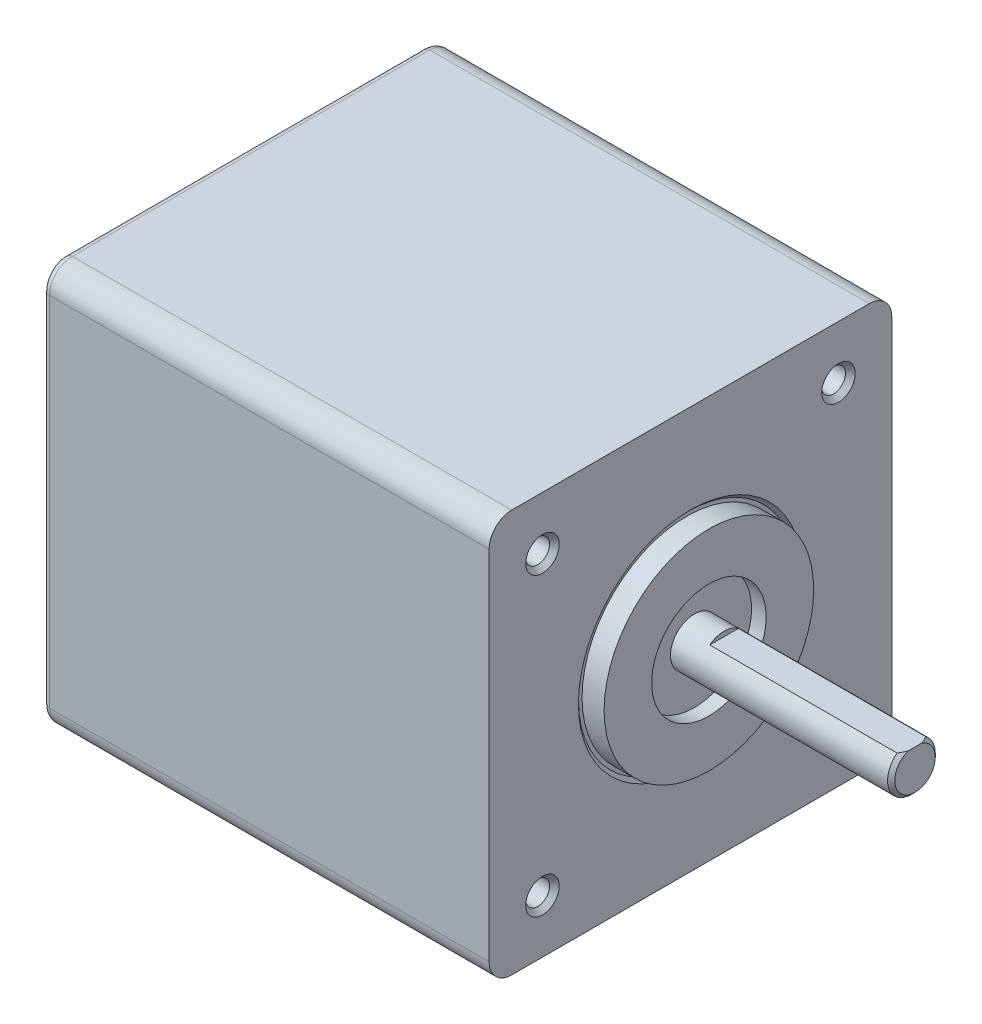
ISO-10303-21;
HEADER;
FILE_DESCRIPTION(('STEP AP214'),'2;1');
FILE_NAME('part.step','',(''),(''),'','','');
FILE_SCHEMA(('AUTOMOTIVE_DESIGN { 1 0 10303 214 1 1 1 1 }'));
ENDSEC;
DATA;
#1=APPLICATION_CONTEXT('core data for automotive mechanical design processes');
#2=APPLICATION_PROTOCOL_DEFINITION('international standard','automotive_design',2000,#1);
#3=PRODUCT_CONTEXT('',#1,'mechanical');
#4=PRODUCT('Part','Part','',(#3));
#5=PRODUCT_RELATED_PRODUCT_CATEGORY('part','',(#4));
#6=PRODUCT_DEFINITION_FORMATION('','',#4);
#7=PRODUCT_DEFINITION_CONTEXT('part definition',#1,'design');
#8=PRODUCT_DEFINITION('design','',#6,#7);
#9=PRODUCT_DEFINITION_SHAPE('','',#8);
#10=(LENGTH_UNIT() NAMED_UNIT(*) SI_UNIT(.MILLI.,.METRE.));
#11=(NAMED_UNIT(*) PLANE_ANGLE_UNIT() SI_UNIT($,.RADIAN.));
#12=(NAMED_UNIT(*) SI_UNIT($,.STERADIAN.) SOLID_ANGLE_UNIT());
#13=UNCERTAINTY_MEASURE_WITH_UNIT(LENGTH_MEASURE(1.E-05),#10,'distance_accuracy_value','');
#14=(GEOMETRIC_REPRESENTATION_CONTEXT(3) GLOBAL_UNCERTAINTY_ASSIGNED_CONTEXT((#13)) GLOBAL_UNIT_ASSIGNED_CONTEXT((#10,
#11,#12)) REPRESENTATION_CONTEXT('',''));
#15=CARTESIAN_POINT('',(0.,0.,0.));
#16=DIRECTION('',(0.,0.,1.));
#17=DIRECTION('',(1.,0.,0.));
#18=AXIS2_PLACEMENT_3D('',#15,#16,#17);
#19=CARTESIAN_POINT('',(23.5204,0.,0.));
#20=DIRECTION('',(1.,0.,0.));
#21=DIRECTION('',(0.,0.,-1.));
#22=AXIS2_PLACEMENT_3D('',#19,#20,#21);
#23=PLANE('',#22);
#24=CARTESIAN_POINT('',(23.5204,0.,0.));
#25=DIRECTION('',(1.,0.,0.));
#26=DIRECTION('',(0.,0.,-1.));
#27=AXIS2_PLACEMENT_3D('',#24,#25,#26);
#28=CIRCLE('',#27,2.11900000000001);
#29=CARTESIAN_POINT('',(23.5204,2.,0.700114990555153));
#30=VERTEX_POINT('',#29);
#31=CARTESIAN_POINT('',(23.5204,2.,-0.700114990555153));
#32=VERTEX_POINT('',#31);
#33=EDGE_CURVE('E264',#30,#32,#28,.T.);
#34=ORIENTED_EDGE('',*,*,#33,.T.);
#35=DIRECTION('',(0.,0.,1.));
#36=VECTOR('',#35,1.);
#37=CARTESIAN_POINT('',(23.5204,2.,0.));
#38=LINE('',#37,#36);
#39=EDGE_CURVE('E326',#32,#30,#38,.T.);
#40=ORIENTED_EDGE('',*,*,#39,.T.);
#41=EDGE_LOOP('',(#34,#40));
#42=FACE_BOUND('',#41,.T.);
#43=ADVANCED_FACE('F37',(#42),#23,.T.);
#44=CARTESIAN_POINT('',(23.5204,0.,0.));
#45=DIRECTION('',(-1.,0.,0.));
#46=DIRECTION('',(0.,0.,1.));
#47=AXIS2_PLACEMENT_3D('',#44,#45,#46);
#48=CONICAL_SURFACE('',#47,2.11900000000001,0.785398163397436);
#49=CARTESIAN_POINT('',(23.1394,0.,0.));
#50=DIRECTION('',(1.,0.,0.));
#51=DIRECTION('',(0.,0.,-1.));
#52=AXIS2_PLACEMENT_3D('',#49,#50,#51);
#53=CIRCLE('',#52,2.5);
#54=CARTESIAN_POINT('',(23.1394,2.,-1.5));
#55=VERTEX_POINT('',#54);
#56=CARTESIAN_POINT('',(23.1394,2.,1.5));
#57=VERTEX_POINT('',#56);
#58=EDGE_CURVE('E262',#55,#57,#53,.F.);
#59=ORIENTED_EDGE('',*,*,#58,.F.);
#60=CARTESIAN_POINT('',(20.1305029464567,2.,-5.13302510675109));
#61=CARTESIAN_POINT('',(20.2766432152961,2.,-4.97613758066621));
#62=CARTESIAN_POINT('',(20.4223570329769,2.,-4.81884691498693));
#63=CARTESIAN_POINT('',(20.7125635794047,2.,-4.50307826927214));
#64=CARTESIAN_POINT('',(20.8570560238053,2.,-4.34460002812423));
#65=CARTESIAN_POINT('',(21.1453468548776,2.,-4.02507998203707));
#66=CARTESIAN_POINT('',(21.2891341179465,2.,-3.8640281174624));
#67=CARTESIAN_POINT('',(21.5743404090381,2.,-3.53986969558392));
#68=CARTESIAN_POINT('',(21.7157597393123,2.,-3.37676340524412));
#69=CARTESIAN_POINT('',(21.9672522314341,2.,-3.08050401123835));
#70=CARTESIAN_POINT('',(22.0779430895347,2.,-2.94787719458969));
#71=CARTESIAN_POINT('',(22.296253159248,2.,-2.68004897490099));
#72=CARTESIAN_POINT('',(22.403871504256,2.,-2.54484686307786));
#73=CARTESIAN_POINT('',(22.6144375947664,2.,-2.27114173408944));
#74=CARTESIAN_POINT('',(22.7173923563596,2.,-2.13264418837074));
#75=CARTESIAN_POINT('',(22.8665613386814,2.,-1.92122241464145));
#76=CARTESIAN_POINT('',(22.9153974728354,2.,-1.85015116668835));
#77=CARTESIAN_POINT('',(23.0108356281588,2.,-1.7065288029276));
#78=CARTESIAN_POINT('',(23.0574379406813,2.,-1.63397788188007));
#79=CARTESIAN_POINT('',(23.1435132711357,2.,-1.49405328577463));
#80=CARTESIAN_POINT('',(23.1832437314983,2.,-1.42683879516308));
#81=CARTESIAN_POINT('',(23.2597251307717,2.,-1.29074520388191));
#82=CARTESIAN_POINT('',(23.2964767330448,2.,-1.22186647828056));
#83=CARTESIAN_POINT('',(23.3661825566363,2.,-1.08220710139237));
#84=CARTESIAN_POINT('',(23.3991376975225,2.,-1.01142691581554));
#85=CARTESIAN_POINT('',(23.4602026851904,2.,-0.867834455711161));
#86=CARTESIAN_POINT('',(23.4883137645082,2.,-0.795022703595676));
#87=CARTESIAN_POINT('',(23.5530039317306,2.,-0.60420200415091));
#88=CARTESIAN_POINT('',(23.5850087876338,2.,-0.484519942763115));
#89=CARTESIAN_POINT('',(23.6175396186327,2.,-0.302480656630293));
#90=CARTESIAN_POINT('',(23.6258030330222,2.,-0.241467844347049));
#91=CARTESIAN_POINT('',(23.6367938274565,2.,-0.118931461021051));
#92=CARTESIAN_POINT('',(23.6395215657536,2.,-0.0574079232896734));
#93=CARTESIAN_POINT('',(23.6392695765936,2.,0.0658292385110691));
#94=CARTESIAN_POINT('',(23.6362708835473,2.,0.127542816035695));
#95=CARTESIAN_POINT('',(23.6247096799287,2.,0.250442666239599));
#96=CARTESIAN_POINT('',(23.6161467429709,2.,0.311628898144493));
#97=CARTESIAN_POINT('',(23.5938892862127,2.,0.433247138403839));
#98=CARTESIAN_POINT('',(23.5801786472414,2.,0.49367615493009));
#99=CARTESIAN_POINT('',(23.5482669478063,2.,0.613320542096463));
#100=CARTESIAN_POINT('',(23.530065625888,2.,0.672535841854645));
#101=CARTESIAN_POINT('',(23.466054269673,2.,0.859006024992759));
#102=CARTESIAN_POINT('',(23.4130731188719,2.,0.983799289462164));
#103=CARTESIAN_POINT('',(23.2951299884697,2.,1.22761567085784));
#104=CARTESIAN_POINT('',(23.2301442899397,2.,1.34662676472427));
#105=CARTESIAN_POINT('',(23.0914542881311,2.,1.58148641293894));
#106=CARTESIAN_POINT('',(23.0176475477158,2.,1.69727367207162));
#107=CARTESIAN_POINT('',(22.8647219139337,2.,1.92508227457241));
#108=CARTESIAN_POINT('',(22.7856078577529,2.,2.03710691116717));
#109=CARTESIAN_POINT('',(22.6044234015249,2.,2.2846894222414));
#110=CARTESIAN_POINT('',(22.5013629666408,2.,2.41951842464185));
#111=CARTESIAN_POINT('',(22.2914325532921,2.,2.68618956943834));
#112=CARTESIAN_POINT('',(22.1845618876755,2.,2.81803116599015));
#113=CARTESIAN_POINT('',(21.9680490707759,2.,3.07964382038147));
#114=CARTESIAN_POINT('',(21.8584041302411,2.,3.20941256154911));
#115=CARTESIAN_POINT('',(21.637182470088,2.,3.46729402373802));
#116=CARTESIAN_POINT('',(21.5256056947972,2.,3.59540669684749));
#117=CARTESIAN_POINT('',(21.3081752038851,2.,3.84222486610579));
#118=CARTESIAN_POINT('',(21.2024105879427,2.,3.9610090127681));
#119=CARTESIAN_POINT('',(20.9898923952322,2.,4.19769358244472));
#120=CARTESIAN_POINT('',(20.8831387940655,2.,4.31559398352618));
#121=CARTESIAN_POINT('',(20.6690928849223,2.,4.55041590189734));
#122=CARTESIAN_POINT('',(20.5618023425473,2.,4.66733903052806));
#123=CARTESIAN_POINT('',(20.3465910389449,2.,4.9005935276883));
#124=CARTESIAN_POINT('',(20.2386703086898,2.,5.01692492478288));
#125=CARTESIAN_POINT('',(20.1305029464567,2.,5.13302510675109));
#126=B_SPLINE_CURVE_WITH_KNOTS('',3,(#60,#61,#62,#63,#64,#65,#66,#67,#68,#69,#70,#71,#72,#73,
#74,#75,#76,#77,#78,#79,#80,#81,#82,#83,#84,#85,#86,#87,#88,#89,#90,#91,#92,#93,#94,#95,#96,#97,
#98,#99,#100,#101,#102,#103,#104,#105,#106,#107,#108,#109,#110,#111,#112,#113,#114,#115,#116,
#117,#118,#119,#120,#121,#122,#123,#124,#125),.UNSPECIFIED.,.F.,.F.,(4,2,2,2,2,2,2,2,2,2,2,2,2,
2,2,2,2,2,2,2,2,2,2,2,2,2,2,2,2,2,2,2,4),(0.,0.643228950079015,1.28660373853272,
1.93428599408931,2.58188493699218,3.10009868410616,3.61845717808637,4.13600800667937,
4.39467521549115,4.65330859452069,4.88748487544512,5.12160886351718,5.35567602298765,
5.5896835375589,5.95969719017452,6.14419319374839,6.32867725691678,6.51377337981913,
6.69888368823195,6.88457853964401,7.07028420504727,7.47588894891609,7.88230384065363,
8.29400662819626,8.7053391505394,9.21435103808055,9.72345519182637,10.2330933086662,
10.7427461370294,11.2198792653615,11.6970241962666,12.1730894394014,12.6491314787712),.UNSPECIFIED.);
#127=EDGE_CURVE('E144',#55,#32,#126,.T.);
#128=ORIENTED_EDGE('',*,*,#127,.T.);
#129=ORIENTED_EDGE('',*,*,#33,.F.);
#130=EDGE_CURVE('E152',#30,#57,#126,.T.);
#131=ORIENTED_EDGE('',*,*,#130,.T.);
#132=EDGE_LOOP('',(#59,#128,#129,#131));
#133=FACE_BOUND('',#132,.T.);
#134=ADVANCED_FACE('F335',(#133),#48,.T.);
#135=CARTESIAN_POINT('',(23.5204,0.,0.));
#136=DIRECTION('',(-1.,0.,0.));
#137=DIRECTION('',(0.,0.,1.));
#138=AXIS2_PLACEMENT_3D('',#135,#136,#137);
#139=CYLINDRICAL_SURFACE('',#138,2.5);
#140=CARTESIAN_POINT('',(0.4064,0.,0.));
#141=DIRECTION('',(1.,0.,0.));
#142=DIRECTION('',(0.,0.,-1.));
#143=AXIS2_PLACEMENT_3D('',#140,#141,#142);
#144=CIRCLE('',#143,2.5);
#145=CARTESIAN_POINT('',(0.4064,0.,-2.5));
#146=VERTEX_POINT('',#145);
#147=EDGE_CURVE('E209',#146,#146,#144,.T.);
#148=ORIENTED_EDGE('',*,*,#147,.T.);
#149=EDGE_LOOP('',(#148));
#150=FACE_BOUND('',#149,.T.);
#151=DIRECTION('',(-1.,0.,0.));
#152=VECTOR('',#151,1.);
#153=CARTESIAN_POINT('',(23.5204,2.,-1.5));
#154=LINE('',#153,#152);
#155=CARTESIAN_POINT('',(3.52039999999999,2.,-1.5));
#156=VERTEX_POINT('',#155);
#157=EDGE_CURVE('E11',#55,#156,#154,.T.);
#158=ORIENTED_EDGE('',*,*,#157,.F.);
#159=ORIENTED_EDGE('',*,*,#58,.T.);
#160=DIRECTION('',(-1.,0.,0.));
#161=VECTOR('',#160,1.);
#162=CARTESIAN_POINT('',(23.5204,2.,1.5));
#163=LINE('',#162,#161);
#164=CARTESIAN_POINT('',(3.52039999999999,2.,1.5));
#165=VERTEX_POINT('',#164);
#166=EDGE_CURVE('E155',#165,#57,#163,.F.);
#167=ORIENTED_EDGE('',*,*,#166,.F.);
#168=CARTESIAN_POINT('',(3.52039999999999,0.,0.));
#169=DIRECTION('',(1.,0.,0.));
#170=DIRECTION('',(0.,0.,-1.));
#171=AXIS2_PLACEMENT_3D('',#168,#169,#170);
#172=CIRCLE('',#171,2.5);
#173=EDGE_CURVE('E45',#156,#165,#172,.T.);
#174=ORIENTED_EDGE('',*,*,#173,.F.);
#175=EDGE_LOOP('',(#158,#159,#167,#174));
#176=FACE_BOUND('',#175,.T.);
#177=ADVANCED_FACE('F154',(#150,#176),#139,.T.);
#178=CARTESIAN_POINT('',(1.9304,0.,0.));
#179=DIRECTION('',(1.,0.,0.));
#180=DIRECTION('',(0.,0.,-1.));
#181=AXIS2_PLACEMENT_3D('',#178,#179,#180);
#182=PLANE('',#181);
#183=CARTESIAN_POINT('',(1.9304,0.,0.));
#184=DIRECTION('',(1.,0.,0.));
#185=DIRECTION('',(0.,0.,-1.));
#186=AXIS2_PLACEMENT_3D('',#183,#184,#185);
#187=CIRCLE('',#186,5.9944);
#188=CARTESIAN_POINT('',(1.9304,0.,-5.9944));
#189=VERTEX_POINT('',#188);
#190=EDGE_CURVE('E319',#189,#189,#187,.T.);
#191=ORIENTED_EDGE('',*,*,#190,.F.);
#192=EDGE_LOOP('',(#191));
#193=FACE_BOUND('',#192,.T.);
#194=CARTESIAN_POINT('',(1.9304,0.,0.));
#195=DIRECTION('',(1.,0.,0.));
#196=DIRECTION('',(0.,0.,-1.));
#197=AXIS2_PLACEMENT_3D('',#194,#195,#196);
#198=CIRCLE('',#197,10.975);
#199=CARTESIAN_POINT('',(1.9304,0.,-10.975));
#200=VERTEX_POINT('',#199);
#201=EDGE_CURVE('E306',#200,#200,#198,.T.);
#202=ORIENTED_EDGE('',*,*,#201,.T.);
#203=EDGE_LOOP('',(#202));
#204=FACE_BOUND('',#203,.T.);
#205=ADVANCED_FACE('F375',(#193,#204),#182,.T.);
#206=CARTESIAN_POINT('',(0.,-21.082,21.082));
#207=DIRECTION('',(-1.,0.,0.));
#208=DIRECTION('',(0.,0.,1.));
#209=AXIS2_PLACEMENT_3D('',#206,#207,#208);
#210=PLANE('',#209);
#211=CARTESIAN_POINT('',(0.,-15.5,15.5));
#212=DIRECTION('',(-1.,0.,0.));
#213=DIRECTION('',(0.,0.,1.));
#214=AXIS2_PLACEMENT_3D('',#211,#212,#213);
#215=CIRCLE('',#214,1.75259999999998);
#216=CARTESIAN_POINT('',(0.,-15.5,17.2526));
#217=VERTEX_POINT('',#216);
#218=EDGE_CURVE('E156',#217,#217,#215,.T.);
#219=ORIENTED_EDGE('',*,*,#218,.T.);
#220=EDGE_LOOP('',(#219));
#221=FACE_BOUND('',#220,.T.);
#222=CARTESIAN_POINT('',(0.,-15.5,-15.5));
#223=DIRECTION('',(-1.,0.,0.));
#224=DIRECTION('',(0.,0.,1.));
#225=AXIS2_PLACEMENT_3D('',#222,#223,#224);
#226=CIRCLE('',#225,1.75259999999998);
#227=CARTESIAN_POINT('',(0.,-15.5,-13.7474));
#228=VERTEX_POINT('',#227);
#229=EDGE_CURVE('E161',#228,#228,#226,.T.);
#230=ORIENTED_EDGE('',*,*,#229,.T.);
#231=EDGE_LOOP('',(#230));
#232=FACE_BOUND('',#231,.T.);
#233=CARTESIAN_POINT('',(0.,15.5,-15.5));
#234=DIRECTION('',(-1.,0.,0.));
#235=DIRECTION('',(0.,0.,1.));
#236=AXIS2_PLACEMENT_3D('',#233,#234,#235);
#237=CIRCLE('',#236,1.75259999999998);
#238=CARTESIAN_POINT('',(0.,15.5,-13.7474));
#239=VERTEX_POINT('',#238);
#240=EDGE_CURVE('E164',#239,#239,#237,.T.);
#241=ORIENTED_EDGE('',*,*,#240,.T.);
#242=EDGE_LOOP('',(#241));
#243=FACE_BOUND('',#242,.T.);
#244=CARTESIAN_POINT('',(0.,15.5,15.5));
#245=DIRECTION('',(-1.,0.,0.));
#246=DIRECTION('',(0.,0.,1.));
#247=AXIS2_PLACEMENT_3D('',#244,#245,#246);
#248=CIRCLE('',#247,1.75259999999998);
#249=CARTESIAN_POINT('',(0.,15.5,17.2526));
#250=VERTEX_POINT('',#249);
#251=EDGE_CURVE('E167',#250,#250,#248,.T.);
#252=ORIENTED_EDGE('',*,*,#251,.T.);
#253=EDGE_LOOP('',(#252));
#254=FACE_BOUND('',#253,.T.);
#255=DIRECTION('',(0.,0.,-1.));
#256=VECTOR('',#255,1.);
#257=CARTESIAN_POINT('',(0.,-21.082,-21.082));
#258=LINE('',#257,#256);
#259=CARTESIAN_POINT('',(0.,-21.082,18.7198));
#260=VERTEX_POINT('',#259);
#261=CARTESIAN_POINT('',(0.,-21.082,-18.7198));
#262=VERTEX_POINT('',#261);
#263=EDGE_CURVE('E300',#260,#262,#258,.T.);
#264=ORIENTED_EDGE('',*,*,#263,.T.);
#265=CARTESIAN_POINT('',(0.,-18.7198,-18.7198));
#266=DIRECTION('',(-1.,0.,0.));
#267=DIRECTION('',(0.,0.,1.));
#268=AXIS2_PLACEMENT_3D('',#265,#266,#267);
#269=CIRCLE('',#268,2.3622);
#270=CARTESIAN_POINT('',(0.,-18.7198,-21.082));
#271=VERTEX_POINT('',#270);
#272=EDGE_CURVE('E281',#262,#271,#269,.F.);
#273=ORIENTED_EDGE('',*,*,#272,.T.);
#274=DIRECTION('',(0.,1.,0.));
#275=VECTOR('',#274,1.);
#276=CARTESIAN_POINT('',(0.,21.082,-21.082));
#277=LINE('',#276,#275);
#278=CARTESIAN_POINT('',(0.,18.7198,-21.082));
#279=VERTEX_POINT('',#278);
#280=EDGE_CURVE('E297',#271,#279,#277,.T.);
#281=ORIENTED_EDGE('',*,*,#280,.T.);
#282=CARTESIAN_POINT('',(0.,18.7198,-18.7198));
#283=DIRECTION('',(-1.,0.,0.));
#284=DIRECTION('',(0.,0.,1.));
#285=AXIS2_PLACEMENT_3D('',#282,#283,#284);
#286=CIRCLE('',#285,2.3622);
#287=CARTESIAN_POINT('',(0.,21.082,-18.7198));
#288=VERTEX_POINT('',#287);
#289=EDGE_CURVE('E283',#279,#288,#286,.F.);
#290=ORIENTED_EDGE('',*,*,#289,.T.);
#291=DIRECTION('',(0.,0.,1.));
#292=VECTOR('',#291,1.);
#293=CARTESIAN_POINT('',(0.,21.082,-21.082));
#294=LINE('',#293,#292);
#295=CARTESIAN_POINT('',(0.,21.082,18.7198));
#296=VERTEX_POINT('',#295);
#297=EDGE_CURVE('E294',#288,#296,#294,.T.);
#298=ORIENTED_EDGE('',*,*,#297,.T.);
#299=CARTESIAN_POINT('',(0.,18.7198,18.7198));
#300=DIRECTION('',(-1.,0.,0.));
#301=DIRECTION('',(0.,0.,1.));
#302=AXIS2_PLACEMENT_3D('',#299,#300,#301);
#303=CIRCLE('',#302,2.3622);
#304=CARTESIAN_POINT('',(0.,18.7198,21.082));
#305=VERTEX_POINT('',#304);
#306=EDGE_CURVE('E287',#296,#305,#303,.F.);
#307=ORIENTED_EDGE('',*,*,#306,.T.);
#308=DIRECTION('',(0.,-1.,0.));
#309=VECTOR('',#308,1.);
#310=CARTESIAN_POINT('',(0.,21.082,21.082));
#311=LINE('',#310,#309);
#312=CARTESIAN_POINT('',(0.,-18.7198,21.082));
#313=VERTEX_POINT('',#312);
#314=EDGE_CURVE('E303',#305,#313,#311,.T.);
#315=ORIENTED_EDGE('',*,*,#314,.T.);
#316=CARTESIAN_POINT('',(0.,-18.7198,18.7198));
#317=DIRECTION('',(-1.,0.,0.));
#318=DIRECTION('',(0.,0.,1.));
#319=AXIS2_PLACEMENT_3D('',#316,#317,#318);
#320=CIRCLE('',#319,2.3622);
#321=EDGE_CURVE('E285',#313,#260,#320,.F.);
#322=ORIENTED_EDGE('',*,*,#321,.T.);
#323=EDGE_LOOP('',(#264,#273,#281,#290,#298,#307,#315,#322));
#324=FACE_BOUND('',#323,.T.);
#325=CARTESIAN_POINT('',(0.,0.,0.));
#326=DIRECTION('',(-1.,0.,0.));
#327=DIRECTION('',(0.,0.,1.));
#328=AXIS2_PLACEMENT_3D('',#325,#326,#327);
#329=CIRCLE('',#328,11.737);
#330=CARTESIAN_POINT('',(0.,0.,11.737));
#331=VERTEX_POINT('',#330);
#332=EDGE_CURVE('E309',#331,#331,#329,.T.);
#333=ORIENTED_EDGE('',*,*,#332,.T.);
#334=EDGE_LOOP('',(#333));
#335=FACE_BOUND('',#334,.T.);
#336=ADVANCED_FACE('F388',(#221,#232,#243,#254,#324,#335),#210,.F.);
#337=CARTESIAN_POINT('',(-46.7868,21.082,21.082));
#338=DIRECTION('',(0.,0.,1.));
#339=DIRECTION('',(0.,-1.,0.));
#340=AXIS2_PLACEMENT_3D('',#337,#338,#339);
#341=PLANE('',#340);
#342=DIRECTION('',(1.,0.,0.));
#343=VECTOR('',#342,1.);
#344=CARTESIAN_POINT('',(-46.7868,18.7198,21.082));
#345=LINE('',#344,#343);
#346=CARTESIAN_POINT('',(-46.0248,18.7198,21.082));
#347=VERTEX_POINT('',#346);
#348=EDGE_CURVE('E269',#305,#347,#345,.F.);
#349=ORIENTED_EDGE('',*,*,#348,.T.);
#350=DIRECTION('',(0.,-1.,0.));
#351=VECTOR('',#350,1.);
#352=CARTESIAN_POINT('',(-46.0248,21.082,21.082));
#353=LINE('',#352,#351);
#354=CARTESIAN_POINT('',(-46.0248,-18.7198,21.082));
#355=VERTEX_POINT('',#354);
#356=EDGE_CURVE('E232',#347,#355,#353,.T.);
#357=ORIENTED_EDGE('',*,*,#356,.T.);
#358=DIRECTION('',(1.,0.,0.));
#359=VECTOR('',#358,1.);
#360=CARTESIAN_POINT('',(-46.7868,-18.7198,21.082));
#361=LINE('',#360,#359);
#362=EDGE_CURVE('E267',#355,#313,#361,.T.);
#363=ORIENTED_EDGE('',*,*,#362,.T.);
#364=ORIENTED_EDGE('',*,*,#314,.F.);
#365=EDGE_LOOP('',(#349,#357,#363,#364));
#366=FACE_BOUND('',#365,.T.);
#367=ADVANCED_FACE('F401',(#366),#341,.T.);
#368=CARTESIAN_POINT('',(-46.7868,21.082,-21.082));
#369=DIRECTION('',(0.,1.,0.));
#370=DIRECTION('',(0.,0.,1.));
#371=AXIS2_PLACEMENT_3D('',#368,#369,#370);
#372=PLANE('',#371);
#373=DIRECTION('',(1.,0.,0.));
#374=VECTOR('',#373,1.);
#375=CARTESIAN_POINT('',(-46.7868,21.082,-18.7198));
#376=LINE('',#375,#374);
#377=CARTESIAN_POINT('',(-46.0248,21.082,-18.7198));
#378=VERTEX_POINT('',#377);
#379=EDGE_CURVE('E272',#288,#378,#376,.F.);
#380=ORIENTED_EDGE('',*,*,#379,.T.);
#381=DIRECTION('',(0.,0.,1.));
#382=VECTOR('',#381,1.);
#383=CARTESIAN_POINT('',(-46.0248,21.082,-21.082));
#384=LINE('',#383,#382);
#385=CARTESIAN_POINT('',(-46.0248,21.082,18.7198));
#386=VERTEX_POINT('',#385);
#387=EDGE_CURVE('E59',#378,#386,#384,.T.);
#388=ORIENTED_EDGE('',*,*,#387,.T.);
#389=DIRECTION('',(1.,0.,0.));
#390=VECTOR('',#389,1.);
#391=CARTESIAN_POINT('',(-46.7868,21.082,18.7198));
#392=LINE('',#391,#390);
#393=EDGE_CURVE('E274',#386,#296,#392,.T.);
#394=ORIENTED_EDGE('',*,*,#393,.T.);
#395=ORIENTED_EDGE('',*,*,#297,.F.);
#396=EDGE_LOOP('',(#380,#388,#394,#395));
#397=FACE_BOUND('',#396,.T.);
#398=ADVANCED_FACE('F403',(#397),#372,.T.);
#399=CARTESIAN_POINT('',(-46.7868,21.082,-21.082));
#400=DIRECTION('',(0.,0.,-1.));
#401=DIRECTION('',(-1.,0.,0.));
#402=AXIS2_PLACEMENT_3D('',#399,#400,#401);
#403=PLANE('',#402);
#404=DIRECTION('',(1.,0.,0.));
#405=VECTOR('',#404,1.);
#406=CARTESIAN_POINT('',(-46.7868,-18.7198,-21.082));
#407=LINE('',#406,#405);
#408=CARTESIAN_POINT('',(-46.0248,-18.7198,-21.082));
#409=VERTEX_POINT('',#408);
#410=EDGE_CURVE('E276',#271,#409,#407,.F.);
#411=ORIENTED_EDGE('',*,*,#410,.T.);
#412=DIRECTION('',(0.,1.,0.));
#413=VECTOR('',#412,1.);
#414=CARTESIAN_POINT('',(-46.0248,21.082,-21.082));
#415=LINE('',#414,#413);
#416=CARTESIAN_POINT('',(-46.0248,18.7198,-21.082));
#417=VERTEX_POINT('',#416);
#418=EDGE_CURVE('E240',#409,#417,#415,.T.);
#419=ORIENTED_EDGE('',*,*,#418,.T.);
#420=DIRECTION('',(1.,0.,0.));
#421=VECTOR('',#420,1.);
#422=CARTESIAN_POINT('',(-46.7868,18.7198,-21.082));
#423=LINE('',#422,#421);
#424=EDGE_CURVE('E279',#417,#279,#423,.T.);
#425=ORIENTED_EDGE('',*,*,#424,.T.);
#426=ORIENTED_EDGE('',*,*,#280,.F.);
#427=EDGE_LOOP('',(#411,#419,#425,#426));
#428=FACE_BOUND('',#427,.T.);
#429=ADVANCED_FACE('F406',(#428),#403,.T.);
#430=CARTESIAN_POINT('',(-46.7868,-21.082,-21.082));
#431=DIRECTION('',(0.,-1.,0.));
#432=DIRECTION('',(0.,0.,-1.));
#433=AXIS2_PLACEMENT_3D('',#430,#431,#432);
#434=PLANE('',#433);
#435=DIRECTION('',(1.,0.,0.));
#436=VECTOR('',#435,1.);
#437=CARTESIAN_POINT('',(-46.7868,-21.082,18.7198));
#438=LINE('',#437,#436);
#439=CARTESIAN_POINT('',(-46.0248,-21.082,18.7198));
#440=VERTEX_POINT('',#439);
#441=EDGE_CURVE('E291',#260,#440,#438,.F.);
#442=ORIENTED_EDGE('',*,*,#441,.T.);
#443=DIRECTION('',(0.,0.,-1.));
#444=VECTOR('',#443,1.);
#445=CARTESIAN_POINT('',(-46.0248,-21.082,-21.082));
#446=LINE('',#445,#444);
#447=CARTESIAN_POINT('',(-46.0248,-21.082,-18.7198));
#448=VERTEX_POINT('',#447);
#449=EDGE_CURVE('E236',#440,#448,#446,.T.);
#450=ORIENTED_EDGE('',*,*,#449,.T.);
#451=DIRECTION('',(1.,0.,0.));
#452=VECTOR('',#451,1.);
#453=CARTESIAN_POINT('',(-46.7868,-21.082,-18.7198));
#454=LINE('',#453,#452);
#455=EDGE_CURVE('E289',#448,#262,#454,.T.);
#456=ORIENTED_EDGE('',*,*,#455,.T.);
#457=ORIENTED_EDGE('',*,*,#263,.F.);
#458=EDGE_LOOP('',(#442,#450,#456,#457));
#459=FACE_BOUND('',#458,.T.);
#460=ADVANCED_FACE('F397',(#459),#434,.T.);
#461=CARTESIAN_POINT('',(-46.7868,-21.082,21.082));
#462=DIRECTION('',(-1.,0.,0.));
#463=DIRECTION('',(0.,0.,1.));
#464=AXIS2_PLACEMENT_3D('',#461,#462,#463);
#465=PLANE('',#464);
#466=CARTESIAN_POINT('',(-46.7868,-15.5,-15.5));
#467=DIRECTION('',(-1.,0.,0.));
#468=DIRECTION('',(0.,0.,1.));
#469=AXIS2_PLACEMENT_3D('',#466,#467,#468);
#470=CIRCLE('',#469,1.75259999999996);
#471=CARTESIAN_POINT('',(-46.7868,-15.5,-13.7474));
#472=VERTEX_POINT('',#471);
#473=EDGE_CURVE('E194',#472,#472,#470,.F.);
#474=ORIENTED_EDGE('',*,*,#473,.T.);
#475=EDGE_LOOP('',(#474));
#476=FACE_BOUND('',#475,.T.);
#477=CARTESIAN_POINT('',(-46.7868,-15.5,15.5));
#478=DIRECTION('',(-1.,0.,0.));
#479=DIRECTION('',(0.,0.,1.));
#480=AXIS2_PLACEMENT_3D('',#477,#478,#479);
#481=CIRCLE('',#480,1.75259999999999);
#482=CARTESIAN_POINT('',(-46.7868,-15.5,17.2526));
#483=VERTEX_POINT('',#482);
#484=EDGE_CURVE('E197',#483,#483,#481,.F.);
#485=ORIENTED_EDGE('',*,*,#484,.T.);
#486=EDGE_LOOP('',(#485));
#487=FACE_BOUND('',#486,.T.);
#488=CARTESIAN_POINT('',(-46.7868,15.5,15.5));
#489=DIRECTION('',(-1.,0.,0.));
#490=DIRECTION('',(0.,0.,1.));
#491=AXIS2_PLACEMENT_3D('',#488,#489,#490);
#492=CIRCLE('',#491,1.75259999999999);
#493=CARTESIAN_POINT('',(-46.7868,15.5,17.2526));
#494=VERTEX_POINT('',#493);
#495=EDGE_CURVE('E200',#494,#494,#492,.F.);
#496=ORIENTED_EDGE('',*,*,#495,.T.);
#497=EDGE_LOOP('',(#496));
#498=FACE_BOUND('',#497,.T.);
#499=CARTESIAN_POINT('',(-46.7868,15.5,-15.5));
#500=DIRECTION('',(-1.,0.,0.));
#501=DIRECTION('',(0.,0.,1.));
#502=AXIS2_PLACEMENT_3D('',#499,#500,#501);
#503=CIRCLE('',#502,1.75259999999996);
#504=CARTESIAN_POINT('',(-46.7868,15.5,-13.7474));
#505=VERTEX_POINT('',#504);
#506=EDGE_CURVE('E203',#505,#505,#503,.F.);
#507=ORIENTED_EDGE('',*,*,#506,.T.);
#508=EDGE_LOOP('',(#507));
#509=FACE_BOUND('',#508,.T.);
#510=DIRECTION('',(0.,0.,1.));
#511=VECTOR('',#510,1.);
#512=CARTESIAN_POINT('',(-46.7868,20.32,21.082));
#513=LINE('',#512,#511);
#514=CARTESIAN_POINT('',(-46.7868,20.32,18.7198));
#515=VERTEX_POINT('',#514);
#516=CARTESIAN_POINT('',(-46.7868,20.32,-18.7198));
#517=VERTEX_POINT('',#516);
#518=EDGE_CURVE('E260',#515,#517,#513,.F.);
#519=ORIENTED_EDGE('',*,*,#518,.T.);
#520=CARTESIAN_POINT('',(-46.7868,18.7198,-18.7198));
#521=DIRECTION('',(-1.,0.,0.));
#522=DIRECTION('',(0.,0.,1.));
#523=AXIS2_PLACEMENT_3D('',#520,#521,#522);
#524=CIRCLE('',#523,1.6002);
#525=CARTESIAN_POINT('',(-46.7868,18.7198,-20.32));
#526=VERTEX_POINT('',#525);
#527=EDGE_CURVE('E245',#517,#526,#524,.T.);
#528=ORIENTED_EDGE('',*,*,#527,.T.);
#529=DIRECTION('',(0.,1.,0.));
#530=VECTOR('',#529,1.);
#531=CARTESIAN_POINT('',(-46.7868,-21.082,-20.32));
#532=LINE('',#531,#530);
#533=CARTESIAN_POINT('',(-46.7868,-18.7198,-20.32));
#534=VERTEX_POINT('',#533);
#535=EDGE_CURVE('E248',#526,#534,#532,.F.);
#536=ORIENTED_EDGE('',*,*,#535,.T.);
#537=CARTESIAN_POINT('',(-46.7868,-18.7198,-18.7198));
#538=DIRECTION('',(-1.,0.,0.));
#539=DIRECTION('',(0.,0.,1.));
#540=AXIS2_PLACEMENT_3D('',#537,#538,#539);
#541=CIRCLE('',#540,1.6002);
#542=CARTESIAN_POINT('',(-46.7868,-20.32,-18.7198));
#543=VERTEX_POINT('',#542);
#544=EDGE_CURVE('E250',#534,#543,#541,.T.);
#545=ORIENTED_EDGE('',*,*,#544,.T.);
#546=DIRECTION('',(0.,0.,-1.));
#547=VECTOR('',#546,1.);
#548=CARTESIAN_POINT('',(-46.7868,-20.32,21.082));
#549=LINE('',#548,#547);
#550=CARTESIAN_POINT('',(-46.7868,-20.32,18.7198));
#551=VERTEX_POINT('',#550);
#552=EDGE_CURVE('E252',#543,#551,#549,.F.);
#553=ORIENTED_EDGE('',*,*,#552,.T.);
#554=CARTESIAN_POINT('',(-46.7868,-18.7198,18.7198));
#555=DIRECTION('',(-1.,0.,0.));
#556=DIRECTION('',(0.,0.,1.));
#557=AXIS2_PLACEMENT_3D('',#554,#555,#556);
#558=CIRCLE('',#557,1.6002);
#559=CARTESIAN_POINT('',(-46.7868,-18.7198,20.32));
#560=VERTEX_POINT('',#559);
#561=EDGE_CURVE('E254',#551,#560,#558,.T.);
#562=ORIENTED_EDGE('',*,*,#561,.T.);
#563=DIRECTION('',(0.,-1.,0.));
#564=VECTOR('',#563,1.);
#565=CARTESIAN_POINT('',(-46.7868,-21.082,20.32));
#566=LINE('',#565,#564);
#567=CARTESIAN_POINT('',(-46.7868,18.7198,20.32));
#568=VERTEX_POINT('',#567);
#569=EDGE_CURVE('E256',#560,#568,#566,.F.);
#570=ORIENTED_EDGE('',*,*,#569,.T.);
#571=CARTESIAN_POINT('',(-46.7868,18.7198,18.7198));
#572=DIRECTION('',(-1.,0.,0.));
#573=DIRECTION('',(0.,0.,1.));
#574=AXIS2_PLACEMENT_3D('',#571,#572,#573);
#575=CIRCLE('',#574,1.6002);
#576=EDGE_CURVE('E258',#568,#515,#575,.T.);
#577=ORIENTED_EDGE('',*,*,#576,.T.);
#578=EDGE_LOOP('',(#519,#528,#536,#545,#553,#562,#570,#577));
#579=FACE_BOUND('',#578,.T.);
#580=ADVANCED_FACE('F393',(#476,#487,#498,#509,#579),#465,.T.);
#581=CARTESIAN_POINT('',(-46.7868,-18.7198,-18.7198));
#582=DIRECTION('',(1.,0.,0.));
#583=DIRECTION('',(0.,0.,-1.));
#584=AXIS2_PLACEMENT_3D('',#581,#582,#583);
#585=CYLINDRICAL_SURFACE('',#584,2.3622);
#586=ORIENTED_EDGE('',*,*,#455,.F.);
#587=CARTESIAN_POINT('',(-46.0248,-18.7198,-18.7198));
#588=DIRECTION('',(-1.,0.,0.));
#589=DIRECTION('',(0.,0.,1.));
#590=AXIS2_PLACEMENT_3D('',#587,#588,#589);
#591=CIRCLE('',#590,2.3622);
#592=EDGE_CURVE('E238',#448,#409,#591,.F.);
#593=ORIENTED_EDGE('',*,*,#592,.T.);
#594=ORIENTED_EDGE('',*,*,#410,.F.);
#595=ORIENTED_EDGE('',*,*,#272,.F.);
#596=EDGE_LOOP('',(#586,#593,#594,#595));
#597=FACE_BOUND('',#596,.T.);
#598=ADVANCED_FACE('F396',(#597),#585,.T.);
#599=CARTESIAN_POINT('',(-46.7868,18.7198,-18.7198));
#600=DIRECTION('',(1.,0.,0.));
#601=DIRECTION('',(0.,0.,-1.));
#602=AXIS2_PLACEMENT_3D('',#599,#600,#601);
#603=CYLINDRICAL_SURFACE('',#602,2.3622);
#604=ORIENTED_EDGE('',*,*,#424,.F.);
#605=CARTESIAN_POINT('',(-46.0248,18.7198,-18.7198));
#606=DIRECTION('',(-1.,0.,0.));
#607=DIRECTION('',(0.,0.,1.));
#608=AXIS2_PLACEMENT_3D('',#605,#606,#607);
#609=CIRCLE('',#608,2.3622);
#610=EDGE_CURVE('E242',#417,#378,#609,.F.);
#611=ORIENTED_EDGE('',*,*,#610,.T.);
#612=ORIENTED_EDGE('',*,*,#379,.F.);
#613=ORIENTED_EDGE('',*,*,#289,.F.);
#614=EDGE_LOOP('',(#604,#611,#612,#613));
#615=FACE_BOUND('',#614,.T.);
#616=ADVANCED_FACE('F418',(#615),#603,.T.);
#617=CARTESIAN_POINT('',(-46.7868,-18.7198,18.7198));
#618=DIRECTION('',(1.,0.,0.));
#619=DIRECTION('',(0.,0.,-1.));
#620=AXIS2_PLACEMENT_3D('',#617,#618,#619);
#621=CYLINDRICAL_SURFACE('',#620,2.3622);
#622=ORIENTED_EDGE('',*,*,#362,.F.);
#623=CARTESIAN_POINT('',(-46.0248,-18.7198,18.7198));
#624=DIRECTION('',(-1.,0.,0.));
#625=DIRECTION('',(0.,0.,1.));
#626=AXIS2_PLACEMENT_3D('',#623,#624,#625);
#627=CIRCLE('',#626,2.3622);
#628=EDGE_CURVE('E234',#355,#440,#627,.F.);
#629=ORIENTED_EDGE('',*,*,#628,.T.);
#630=ORIENTED_EDGE('',*,*,#441,.F.);
#631=ORIENTED_EDGE('',*,*,#321,.F.);
#632=EDGE_LOOP('',(#622,#629,#630,#631));
#633=FACE_BOUND('',#632,.T.);
#634=ADVANCED_FACE('F422',(#633),#621,.T.);
#635=CARTESIAN_POINT('',(-46.7868,18.7198,18.7198));
#636=DIRECTION('',(1.,0.,0.));
#637=DIRECTION('',(0.,0.,-1.));
#638=AXIS2_PLACEMENT_3D('',#635,#636,#637);
#639=CYLINDRICAL_SURFACE('',#638,2.3622);
#640=ORIENTED_EDGE('',*,*,#393,.F.);
#641=CARTESIAN_POINT('',(-46.0248,18.7198,18.7198));
#642=DIRECTION('',(-1.,0.,0.));
#643=DIRECTION('',(0.,0.,1.));
#644=AXIS2_PLACEMENT_3D('',#641,#642,#643);
#645=CIRCLE('',#644,2.3622);
#646=EDGE_CURVE('E230',#386,#347,#645,.F.);
#647=ORIENTED_EDGE('',*,*,#646,.T.);
#648=ORIENTED_EDGE('',*,*,#348,.F.);
#649=ORIENTED_EDGE('',*,*,#306,.F.);
#650=EDGE_LOOP('',(#640,#647,#648,#649));
#651=FACE_BOUND('',#650,.T.);
#652=ADVANCED_FACE('F384',(#651),#639,.T.);
#653=CARTESIAN_POINT('',(0.,0.,0.));
#654=DIRECTION('',(1.,0.,0.));
#655=DIRECTION('',(0.,0.,-1.));
#656=AXIS2_PLACEMENT_3D('',#653,#654,#655);
#657=CONICAL_SURFACE('',#656,11.737,0.785398163397451);
#658=CARTESIAN_POINT('',(-0.380999999999999,0.,0.));
#659=DIRECTION('',(-1.,0.,0.));
#660=DIRECTION('',(0.,0.,1.));
#661=AXIS2_PLACEMENT_3D('',#658,#659,#660);
#662=CIRCLE('',#661,11.356);
#663=CARTESIAN_POINT('',(-0.380999999999999,0.,11.356));
#664=VERTEX_POINT('',#663);
#665=EDGE_CURVE('E312',#664,#664,#662,.T.);
#666=ORIENTED_EDGE('',*,*,#665,.T.);
#667=EDGE_LOOP('',(#666));
#668=FACE_BOUND('',#667,.T.);
#669=ORIENTED_EDGE('',*,*,#332,.F.);
#670=EDGE_LOOP('',(#669));
#671=FACE_BOUND('',#670,.T.);
#672=ADVANCED_FACE('F380',(#668,#671),#657,.F.);
#673=CARTESIAN_POINT('',(-0.380999999999999,10.975,0.));
#674=DIRECTION('',(1.,0.,0.));
#675=DIRECTION('',(0.,0.,-1.));
#676=AXIS2_PLACEMENT_3D('',#673,#674,#675);
#677=PLANE('',#676);
#678=CARTESIAN_POINT('',(-0.380999999999999,0.,0.));
#679=DIRECTION('',(-1.,0.,0.));
#680=DIRECTION('',(0.,0.,1.));
#681=AXIS2_PLACEMENT_3D('',#678,#679,#680);
#682=CIRCLE('',#681,10.975);
#683=CARTESIAN_POINT('',(-0.380999999999999,0.,10.975));
#684=VERTEX_POINT('',#683);
#685=EDGE_CURVE('E315',#684,#684,#682,.T.);
#686=ORIENTED_EDGE('',*,*,#685,.T.);
#687=EDGE_LOOP('',(#686));
#688=FACE_BOUND('',#687,.T.);
#689=ORIENTED_EDGE('',*,*,#665,.F.);
#690=EDGE_LOOP('',(#689));
#691=FACE_BOUND('',#690,.T.);
#692=ADVANCED_FACE('F377',(#688,#691),#677,.T.);
#693=CARTESIAN_POINT('',(1.9304,0.,0.));
#694=DIRECTION('',(-1.,0.,0.));
#695=DIRECTION('',(0.,0.,1.));
#696=AXIS2_PLACEMENT_3D('',#693,#694,#695);
#697=CYLINDRICAL_SURFACE('',#696,10.975);
#698=ORIENTED_EDGE('',*,*,#201,.F.);
#699=EDGE_LOOP('',(#698));
#700=FACE_BOUND('',#699,.T.);
#701=ORIENTED_EDGE('',*,*,#685,.F.);
#702=EDGE_LOOP('',(#701));
#703=FACE_BOUND('',#702,.T.);
#704=ADVANCED_FACE('F368',(#700,#703),#697,.T.);
#705=CARTESIAN_POINT('',(0.4064,0.,0.));
#706=DIRECTION('',(1.,0.,0.));
#707=DIRECTION('',(0.,0.,-1.));
#708=AXIS2_PLACEMENT_3D('',#705,#706,#707);
#709=CYLINDRICAL_SURFACE('',#708,5.9944);
#710=CARTESIAN_POINT('',(0.4064,0.,0.));
#711=DIRECTION('',(1.,0.,0.));
#712=DIRECTION('',(0.,0.,-1.));
#713=AXIS2_PLACEMENT_3D('',#710,#711,#712);
#714=CIRCLE('',#713,5.9944);
#715=CARTESIAN_POINT('',(0.4064,0.,-5.9944));
#716=VERTEX_POINT('',#715);
#717=EDGE_CURVE('E318',#716,#716,#714,.T.);
#718=ORIENTED_EDGE('',*,*,#717,.F.);
#719=EDGE_LOOP('',(#718));
#720=FACE_BOUND('',#719,.T.);
#721=ORIENTED_EDGE('',*,*,#190,.T.);
#722=EDGE_LOOP('',(#721));
#723=FACE_BOUND('',#722,.T.);
#724=ADVANCED_FACE('F364',(#720,#723),#709,.F.);
#725=CARTESIAN_POINT('',(0.4064,0.,0.));
#726=DIRECTION('',(1.,0.,0.));
#727=DIRECTION('',(0.,0.,-1.));
#728=AXIS2_PLACEMENT_3D('',#725,#726,#727);
#729=PLANE('',#728);
#730=ORIENTED_EDGE('',*,*,#147,.F.);
#731=EDGE_LOOP('',(#730));
#732=FACE_BOUND('',#731,.T.);
#733=ORIENTED_EDGE('',*,*,#717,.T.);
#734=EDGE_LOOP('',(#733));
#735=FACE_BOUND('',#734,.T.);
#736=ADVANCED_FACE('F360',(#732,#735),#729,.T.);
#737=CARTESIAN_POINT('',(-46.7868,15.5,15.5));
#738=DIRECTION('',(1.,0.,0.));
#739=DIRECTION('',(0.,0.,-1.));
#740=AXIS2_PLACEMENT_3D('',#737,#738,#739);
#741=CYLINDRICAL_SURFACE('',#740,1.2446);
#742=CARTESIAN_POINT('',(-46.2788,15.5,15.5));
#743=DIRECTION('',(-1.,0.,0.));
#744=DIRECTION('',(0.,0.,1.));
#745=AXIS2_PLACEMENT_3D('',#742,#743,#744);
#746=CIRCLE('',#745,1.2446);
#747=CARTESIAN_POINT('',(-46.2788,15.5,16.7446));
#748=VERTEX_POINT('',#747);
#749=EDGE_CURVE('E176',#748,#748,#746,.T.);
#750=ORIENTED_EDGE('',*,*,#749,.T.);
#751=EDGE_LOOP('',(#750));
#752=FACE_BOUND('',#751,.T.);
#753=CARTESIAN_POINT('',(-0.507999999999988,15.5,15.5));
#754=DIRECTION('',(-1.,0.,0.));
#755=DIRECTION('',(0.,0.,1.));
#756=AXIS2_PLACEMENT_3D('',#753,#754,#755);
#757=CIRCLE('',#756,1.2446);
#758=CARTESIAN_POINT('',(-0.507999999999988,15.5,16.7446));
#759=VERTEX_POINT('',#758);
#760=EDGE_CURVE('E179',#759,#759,#757,.F.);
#761=ORIENTED_EDGE('',*,*,#760,.T.);
#762=EDGE_LOOP('',(#761));
#763=FACE_BOUND('',#762,.T.);
#764=ADVANCED_FACE('F356',(#752,#763),#741,.F.);
#765=CARTESIAN_POINT('',(-46.7868,-15.5,15.5));
#766=DIRECTION('',(1.,0.,0.));
#767=DIRECTION('',(0.,0.,-1.));
#768=AXIS2_PLACEMENT_3D('',#765,#766,#767);
#769=CYLINDRICAL_SURFACE('',#768,1.2446);
#770=CARTESIAN_POINT('',(-46.2788,-15.5,15.5));
#771=DIRECTION('',(-1.,0.,0.));
#772=DIRECTION('',(0.,0.,1.));
#773=AXIS2_PLACEMENT_3D('',#770,#771,#772);
#774=CIRCLE('',#773,1.2446);
#775=CARTESIAN_POINT('',(-46.2788,-15.5,16.7446));
#776=VERTEX_POINT('',#775);
#777=EDGE_CURVE('E182',#776,#776,#774,.T.);
#778=ORIENTED_EDGE('',*,*,#777,.T.);
#779=EDGE_LOOP('',(#778));
#780=FACE_BOUND('',#779,.T.);
#781=CARTESIAN_POINT('',(-0.507999999999988,-15.5,15.5));
#782=DIRECTION('',(-1.,0.,0.));
#783=DIRECTION('',(0.,0.,1.));
#784=AXIS2_PLACEMENT_3D('',#781,#782,#783);
#785=CIRCLE('',#784,1.2446);
#786=CARTESIAN_POINT('',(-0.507999999999988,-15.5,16.7446));
#787=VERTEX_POINT('',#786);
#788=EDGE_CURVE('E185',#787,#787,#785,.F.);
#789=ORIENTED_EDGE('',*,*,#788,.T.);
#790=EDGE_LOOP('',(#789));
#791=FACE_BOUND('',#790,.T.);
#792=ADVANCED_FACE('F352',(#780,#791),#769,.F.);
#793=CARTESIAN_POINT('',(-46.7868,-15.5,-15.5));
#794=DIRECTION('',(1.,0.,0.));
#795=DIRECTION('',(0.,0.,-1.));
#796=AXIS2_PLACEMENT_3D('',#793,#794,#795);
#797=CYLINDRICAL_SURFACE('',#796,1.2446);
#798=CARTESIAN_POINT('',(-46.2788,-15.5,-15.5));
#799=DIRECTION('',(-1.,0.,0.));
#800=DIRECTION('',(0.,0.,1.));
#801=AXIS2_PLACEMENT_3D('',#798,#799,#800);
#802=CIRCLE('',#801,1.2446);
#803=CARTESIAN_POINT('',(-46.2788,-15.5,-14.2554));
#804=VERTEX_POINT('',#803);
#805=EDGE_CURVE('E188',#804,#804,#802,.T.);
#806=ORIENTED_EDGE('',*,*,#805,.T.);
#807=EDGE_LOOP('',(#806));
#808=FACE_BOUND('',#807,.T.);
#809=CARTESIAN_POINT('',(-0.507999999999995,-15.5,-15.5));
#810=DIRECTION('',(-1.,0.,0.));
#811=DIRECTION('',(0.,0.,1.));
#812=AXIS2_PLACEMENT_3D('',#809,#810,#811);
#813=CIRCLE('',#812,1.2446);
#814=CARTESIAN_POINT('',(-0.507999999999995,-15.5,-14.2554));
#815=VERTEX_POINT('',#814);
#816=EDGE_CURVE('E191',#815,#815,#813,.F.);
#817=ORIENTED_EDGE('',*,*,#816,.T.);
#818=EDGE_LOOP('',(#817));
#819=FACE_BOUND('',#818,.T.);
#820=ADVANCED_FACE('F348',(#808,#819),#797,.F.);
#821=CARTESIAN_POINT('',(-46.7868,15.5,-15.5));
#822=DIRECTION('',(1.,0.,0.));
#823=DIRECTION('',(0.,0.,-1.));
#824=AXIS2_PLACEMENT_3D('',#821,#822,#823);
#825=CYLINDRICAL_SURFACE('',#824,1.2446);
#826=CARTESIAN_POINT('',(-46.2788,15.5,-15.5));
#827=DIRECTION('',(-1.,0.,0.));
#828=DIRECTION('',(0.,0.,1.));
#829=AXIS2_PLACEMENT_3D('',#826,#827,#828);
#830=CIRCLE('',#829,1.2446);
#831=CARTESIAN_POINT('',(-46.2788,15.5,-14.2554));
#832=VERTEX_POINT('',#831);
#833=EDGE_CURVE('E170',#832,#832,#830,.T.);
#834=ORIENTED_EDGE('',*,*,#833,.T.);
#835=EDGE_LOOP('',(#834));
#836=FACE_BOUND('',#835,.T.);
#837=CARTESIAN_POINT('',(-0.507999999999995,15.5,-15.5));
#838=DIRECTION('',(-1.,0.,0.));
#839=DIRECTION('',(0.,0.,1.));
#840=AXIS2_PLACEMENT_3D('',#837,#838,#839);
#841=CIRCLE('',#840,1.2446);
#842=CARTESIAN_POINT('',(-0.507999999999995,15.5,-14.2554));
#843=VERTEX_POINT('',#842);
#844=EDGE_CURVE('E173',#843,#843,#841,.F.);
#845=ORIENTED_EDGE('',*,*,#844,.T.);
#846=EDGE_LOOP('',(#845));
#847=FACE_BOUND('',#846,.T.);
#848=ADVANCED_FACE('F344',(#836,#847),#825,.F.);
#849=CARTESIAN_POINT('',(-46.0248,-18.7198,18.7198));
#850=DIRECTION('',(-1.,0.,0.));
#851=DIRECTION('',(0.,0.,1.));
#852=AXIS2_PLACEMENT_3D('',#849,#850,#851);
#853=TOROIDAL_SURFACE('',#852,1.6002,0.762);
#854=CARTESIAN_POINT('',(-46.0248,-20.32,18.7198));
#855=DIRECTION('',(0.,0.,-1.));
#856=DIRECTION('',(-1.,0.,0.));
#857=AXIS2_PLACEMENT_3D('',#854,#855,#856);
#858=CIRCLE('',#857,0.762);
#859=EDGE_CURVE('E210',#440,#551,#858,.T.);
#860=ORIENTED_EDGE('',*,*,#859,.F.);
#861=ORIENTED_EDGE('',*,*,#628,.F.);
#862=CARTESIAN_POINT('',(-46.0248,-18.7198,20.32));
#863=DIRECTION('',(0.,1.,0.));
#864=DIRECTION('',(0.,0.,1.));
#865=AXIS2_PLACEMENT_3D('',#862,#863,#864);
#866=CIRCLE('',#865,0.762);
#867=EDGE_CURVE('E206',#560,#355,#866,.T.);
#868=ORIENTED_EDGE('',*,*,#867,.F.);
#869=ORIENTED_EDGE('',*,*,#561,.F.);
#870=EDGE_LOOP('',(#860,#861,#868,#869));
#871=FACE_BOUND('',#870,.T.);
#872=ADVANCED_FACE('F347',(#871),#853,.T.);
#873=CARTESIAN_POINT('',(-46.0248,21.082,20.32));
#874=DIRECTION('',(0.,-1.,0.));
#875=DIRECTION('',(0.,0.,-1.));
#876=AXIS2_PLACEMENT_3D('',#873,#874,#875);
#877=CYLINDRICAL_SURFACE('',#876,0.762);
#878=ORIENTED_EDGE('',*,*,#867,.T.);
#879=ORIENTED_EDGE('',*,*,#356,.F.);
#880=CARTESIAN_POINT('',(-46.0248,18.7198,20.32));
#881=DIRECTION('',(0.,1.,0.));
#882=DIRECTION('',(0.,0.,1.));
#883=AXIS2_PLACEMENT_3D('',#880,#881,#882);
#884=CIRCLE('',#883,0.762);
#885=EDGE_CURVE('E213',#568,#347,#884,.T.);
#886=ORIENTED_EDGE('',*,*,#885,.F.);
#887=ORIENTED_EDGE('',*,*,#569,.F.);
#888=EDGE_LOOP('',(#878,#879,#886,#887));
#889=FACE_BOUND('',#888,.T.);
#890=ADVANCED_FACE('F450',(#889),#877,.T.);
#891=CARTESIAN_POINT('',(-46.0248,-20.32,-21.082));
#892=DIRECTION('',(0.,0.,-1.));
#893=DIRECTION('',(0.,1.,0.));
#894=AXIS2_PLACEMENT_3D('',#891,#892,#893);
#895=CYLINDRICAL_SURFACE('',#894,0.762);
#896=ORIENTED_EDGE('',*,*,#859,.T.);
#897=ORIENTED_EDGE('',*,*,#552,.F.);
#898=CARTESIAN_POINT('',(-46.0248,-20.32,-18.7198));
#899=DIRECTION('',(0.,0.,-1.));
#900=DIRECTION('',(-1.,0.,0.));
#901=AXIS2_PLACEMENT_3D('',#898,#899,#900);
#902=CIRCLE('',#901,0.762);
#903=EDGE_CURVE('E216',#448,#543,#902,.T.);
#904=ORIENTED_EDGE('',*,*,#903,.F.);
#905=ORIENTED_EDGE('',*,*,#449,.F.);
#906=EDGE_LOOP('',(#896,#897,#904,#905));
#907=FACE_BOUND('',#906,.T.);
#908=ADVANCED_FACE('F462',(#907),#895,.T.);
#909=CARTESIAN_POINT('',(-46.0248,18.7198,18.7198));
#910=DIRECTION('',(-1.,0.,0.));
#911=DIRECTION('',(0.,0.,1.));
#912=AXIS2_PLACEMENT_3D('',#909,#910,#911);
#913=TOROIDAL_SURFACE('',#912,1.6002,0.762);
#914=ORIENTED_EDGE('',*,*,#885,.T.);
#915=ORIENTED_EDGE('',*,*,#646,.F.);
#916=CARTESIAN_POINT('',(-46.0248,20.32,18.7198));
#917=DIRECTION('',(0.,0.,-1.));
#918=DIRECTION('',(-1.,0.,0.));
#919=AXIS2_PLACEMENT_3D('',#916,#917,#918);
#920=CIRCLE('',#919,0.762);
#921=EDGE_CURVE('E219',#515,#386,#920,.T.);
#922=ORIENTED_EDGE('',*,*,#921,.F.);
#923=ORIENTED_EDGE('',*,*,#576,.F.);
#924=EDGE_LOOP('',(#914,#915,#922,#923));
#925=FACE_BOUND('',#924,.T.);
#926=ADVANCED_FACE('F436',(#925),#913,.T.);
#927=CARTESIAN_POINT('',(-46.0248,-18.7198,-18.7198));
#928=DIRECTION('',(-1.,0.,0.));
#929=DIRECTION('',(0.,0.,1.));
#930=AXIS2_PLACEMENT_3D('',#927,#928,#929);
#931=TOROIDAL_SURFACE('',#930,1.6002,0.762);
#932=ORIENTED_EDGE('',*,*,#903,.T.);
#933=ORIENTED_EDGE('',*,*,#544,.F.);
#934=CARTESIAN_POINT('',(-46.0248,-18.7198,-20.32));
#935=DIRECTION('',(0.,1.,0.));
#936=DIRECTION('',(0.,0.,1.));
#937=AXIS2_PLACEMENT_3D('',#934,#935,#936);
#938=CIRCLE('',#937,0.762);
#939=EDGE_CURVE('E222',#409,#534,#938,.T.);
#940=ORIENTED_EDGE('',*,*,#939,.F.);
#941=ORIENTED_EDGE('',*,*,#592,.F.);
#942=EDGE_LOOP('',(#932,#933,#940,#941));
#943=FACE_BOUND('',#942,.T.);
#944=ADVANCED_FACE('F485',(#943),#931,.T.);
#945=CARTESIAN_POINT('',(-46.0248,20.32,-21.082));
#946=DIRECTION('',(0.,0.,1.));
#947=DIRECTION('',(0.,-1.,0.));
#948=AXIS2_PLACEMENT_3D('',#945,#946,#947);
#949=CYLINDRICAL_SURFACE('',#948,0.762);
#950=ORIENTED_EDGE('',*,*,#921,.T.);
#951=ORIENTED_EDGE('',*,*,#387,.F.);
#952=CARTESIAN_POINT('',(-46.0248,20.32,-18.7198));
#953=DIRECTION('',(0.,0.,-1.));
#954=DIRECTION('',(-1.,0.,0.));
#955=AXIS2_PLACEMENT_3D('',#952,#953,#954);
#956=CIRCLE('',#955,0.762);
#957=EDGE_CURVE('E225',#517,#378,#956,.T.);
#958=ORIENTED_EDGE('',*,*,#957,.F.);
#959=ORIENTED_EDGE('',*,*,#518,.F.);
#960=EDGE_LOOP('',(#950,#951,#958,#959));
#961=FACE_BOUND('',#960,.T.);
#962=ADVANCED_FACE('F441',(#961),#949,.T.);
#963=CARTESIAN_POINT('',(-46.0248,21.082,-20.32));
#964=DIRECTION('',(0.,1.,0.));
#965=DIRECTION('',(0.,0.,1.));
#966=AXIS2_PLACEMENT_3D('',#963,#964,#965);
#967=CYLINDRICAL_SURFACE('',#966,0.762);
#968=ORIENTED_EDGE('',*,*,#939,.T.);
#969=ORIENTED_EDGE('',*,*,#535,.F.);
#970=CARTESIAN_POINT('',(-46.0248,18.7198,-20.32));
#971=DIRECTION('',(0.,1.,0.));
#972=DIRECTION('',(0.,0.,1.));
#973=AXIS2_PLACEMENT_3D('',#970,#971,#972);
#974=CIRCLE('',#973,0.762);
#975=EDGE_CURVE('E227',#417,#526,#974,.T.);
#976=ORIENTED_EDGE('',*,*,#975,.F.);
#977=ORIENTED_EDGE('',*,*,#418,.F.);
#978=EDGE_LOOP('',(#968,#969,#976,#977));
#979=FACE_BOUND('',#978,.T.);
#980=ADVANCED_FACE('F481',(#979),#967,.T.);
#981=CARTESIAN_POINT('',(-46.0248,18.7198,-18.7198));
#982=DIRECTION('',(-1.,0.,0.));
#983=DIRECTION('',(0.,0.,1.));
#984=AXIS2_PLACEMENT_3D('',#981,#982,#983);
#985=TOROIDAL_SURFACE('',#984,1.6002,0.762);
#986=ORIENTED_EDGE('',*,*,#957,.T.);
#987=ORIENTED_EDGE('',*,*,#610,.F.);
#988=ORIENTED_EDGE('',*,*,#975,.T.);
#989=ORIENTED_EDGE('',*,*,#527,.F.);
#990=EDGE_LOOP('',(#986,#987,#988,#989));
#991=FACE_BOUND('',#990,.T.);
#992=ADVANCED_FACE('F477',(#991),#985,.T.);
#993=CARTESIAN_POINT('',(-46.7868,-15.5,-15.5));
#994=DIRECTION('',(-1.,0.,0.));
#995=DIRECTION('',(0.,0.,1.));
#996=AXIS2_PLACEMENT_3D('',#993,#994,#995);
#997=CONICAL_SURFACE('',#996,1.75259999999997,0.78539816339744);
#998=ORIENTED_EDGE('',*,*,#805,.F.);
#999=EDGE_LOOP('',(#998));
#1000=FACE_BOUND('',#999,.T.);
#1001=ORIENTED_EDGE('',*,*,#473,.F.);
#1002=EDGE_LOOP('',(#1001));
#1003=FACE_BOUND('',#1002,.T.);
#1004=ADVANCED_FACE('F502',(#1000,#1003),#997,.F.);
#1005=CARTESIAN_POINT('',(-46.7868,-15.5,15.5));
#1006=DIRECTION('',(-1.,0.,0.));
#1007=DIRECTION('',(0.,0.,1.));
#1008=AXIS2_PLACEMENT_3D('',#1005,#1006,#1007);
#1009=CONICAL_SURFACE('',#1008,1.75259999999999,0.785398163397433);
#1010=ORIENTED_EDGE('',*,*,#777,.F.);
#1011=EDGE_LOOP('',(#1010));
#1012=FACE_BOUND('',#1011,.T.);
#1013=ORIENTED_EDGE('',*,*,#484,.F.);
#1014=EDGE_LOOP('',(#1013));
#1015=FACE_BOUND('',#1014,.T.);
#1016=ADVANCED_FACE('F505',(#1012,#1015),#1009,.F.);
#1017=CARTESIAN_POINT('',(-46.7868,15.5,15.5));
#1018=DIRECTION('',(-1.,0.,0.));
#1019=DIRECTION('',(0.,0.,1.));
#1020=AXIS2_PLACEMENT_3D('',#1017,#1018,#1019);
#1021=CONICAL_SURFACE('',#1020,1.75259999999999,0.785398163397433);
#1022=ORIENTED_EDGE('',*,*,#749,.F.);
#1023=EDGE_LOOP('',(#1022));
#1024=FACE_BOUND('',#1023,.T.);
#1025=ORIENTED_EDGE('',*,*,#495,.F.);
#1026=EDGE_LOOP('',(#1025));
#1027=FACE_BOUND('',#1026,.T.);
#1028=ADVANCED_FACE('F509',(#1024,#1027),#1021,.F.);
#1029=CARTESIAN_POINT('',(-46.7868,15.5,-15.5));
#1030=DIRECTION('',(-1.,0.,0.));
#1031=DIRECTION('',(0.,0.,1.));
#1032=AXIS2_PLACEMENT_3D('',#1029,#1030,#1031);
#1033=CONICAL_SURFACE('',#1032,1.75259999999997,0.78539816339744);
#1034=ORIENTED_EDGE('',*,*,#833,.F.);
#1035=EDGE_LOOP('',(#1034));
#1036=FACE_BOUND('',#1035,.T.);
#1037=ORIENTED_EDGE('',*,*,#506,.F.);
#1038=EDGE_LOOP('',(#1037));
#1039=FACE_BOUND('',#1038,.T.);
#1040=ADVANCED_FACE('F513',(#1036,#1039),#1033,.F.);
#1041=CARTESIAN_POINT('',(0.,-15.5,15.5));
#1042=DIRECTION('',(1.,0.,0.));
#1043=DIRECTION('',(0.,0.,-1.));
#1044=AXIS2_PLACEMENT_3D('',#1041,#1042,#1043);
#1045=CONICAL_SURFACE('',#1044,1.75259999999998,0.78539816339744);
#1046=ORIENTED_EDGE('',*,*,#788,.F.);
#1047=EDGE_LOOP('',(#1046));
#1048=FACE_BOUND('',#1047,.T.);
#1049=ORIENTED_EDGE('',*,*,#218,.F.);
#1050=EDGE_LOOP('',(#1049));
#1051=FACE_BOUND('',#1050,.T.);
#1052=ADVANCED_FACE('F517',(#1048,#1051),#1045,.F.);
#1053=CARTESIAN_POINT('',(0.,-15.5,-15.5));
#1054=DIRECTION('',(1.,0.,0.));
#1055=DIRECTION('',(0.,0.,-1.));
#1056=AXIS2_PLACEMENT_3D('',#1053,#1054,#1055);
#1057=CONICAL_SURFACE('',#1056,1.75259999999998,0.785398163397435);
#1058=ORIENTED_EDGE('',*,*,#816,.F.);
#1059=EDGE_LOOP('',(#1058));
#1060=FACE_BOUND('',#1059,.T.);
#1061=ORIENTED_EDGE('',*,*,#229,.F.);
#1062=EDGE_LOOP('',(#1061));
#1063=FACE_BOUND('',#1062,.T.);
#1064=ADVANCED_FACE('F521',(#1060,#1063),#1057,.F.);
#1065=CARTESIAN_POINT('',(0.,15.5,-15.5));
#1066=DIRECTION('',(1.,0.,0.));
#1067=DIRECTION('',(0.,0.,-1.));
#1068=AXIS2_PLACEMENT_3D('',#1065,#1066,#1067);
#1069=CONICAL_SURFACE('',#1068,1.75259999999998,0.785398163397435);
#1070=ORIENTED_EDGE('',*,*,#844,.F.);
#1071=EDGE_LOOP('',(#1070));
#1072=FACE_BOUND('',#1071,.T.);
#1073=ORIENTED_EDGE('',*,*,#240,.F.);
#1074=EDGE_LOOP('',(#1073));
#1075=FACE_BOUND('',#1074,.T.);
#1076=ADVANCED_FACE('F524',(#1072,#1075),#1069,.F.);
#1077=CARTESIAN_POINT('',(0.,15.5,15.5));
#1078=DIRECTION('',(1.,0.,0.));
#1079=DIRECTION('',(0.,0.,-1.));
#1080=AXIS2_PLACEMENT_3D('',#1077,#1078,#1079);
#1081=CONICAL_SURFACE('',#1080,1.75259999999998,0.78539816339744);
#1082=ORIENTED_EDGE('',*,*,#760,.F.);
#1083=EDGE_LOOP('',(#1082));
#1084=FACE_BOUND('',#1083,.T.);
#1085=ORIENTED_EDGE('',*,*,#251,.F.);
#1086=EDGE_LOOP('',(#1085));
#1087=FACE_BOUND('',#1086,.T.);
#1088=ADVANCED_FACE('F39',(#1084,#1087),#1081,.F.);
#1089=CARTESIAN_POINT('',(3.52039999999999,21.082,13.6401465305687));
#1090=DIRECTION('',(1.,0.,0.));
#1091=DIRECTION('',(0.,0.,-1.));
#1092=AXIS2_PLACEMENT_3D('',#1089,#1090,#1091);
#1093=PLANE('',#1092);
#1094=ORIENTED_EDGE('',*,*,#173,.T.);
#1095=DIRECTION('',(0.,0.,1.));
#1096=VECTOR('',#1095,1.);
#1097=CARTESIAN_POINT('',(3.52039999999999,2.,13.6401465305687));
#1098=LINE('',#1097,#1096);
#1099=EDGE_CURVE('E51',#156,#165,#1098,.T.);
#1100=ORIENTED_EDGE('',*,*,#1099,.F.);
#1101=EDGE_LOOP('',(#1094,#1100));
#1102=FACE_BOUND('',#1101,.T.);
#1103=ADVANCED_FACE('F150',(#1102),#1093,.T.);
#1104=CARTESIAN_POINT('',(0.,2.,0.));
#1105=DIRECTION('',(0.,1.,0.));
#1106=DIRECTION('',(0.,0.,1.));
#1107=AXIS2_PLACEMENT_3D('',#1104,#1105,#1106);
#1108=PLANE('',#1107);
#1109=ORIENTED_EDGE('',*,*,#157,.T.);
#1110=ORIENTED_EDGE('',*,*,#1099,.T.);
#1111=ORIENTED_EDGE('',*,*,#166,.T.);
#1112=ORIENTED_EDGE('',*,*,#130,.F.);
#1113=ORIENTED_EDGE('',*,*,#39,.F.);
#1114=ORIENTED_EDGE('',*,*,#127,.F.);
#1115=EDGE_LOOP('',(#1109,#1110,#1111,#1112,#1113,#1114));
#1116=FACE_BOUND('',#1115,.T.);
#1117=ADVANCED_FACE('F142',(#1116),#1108,.T.);
#1118=CLOSED_SHELL('',(#43,#134,#177,#205,#336,#367,#398,#429,#460,#580,#598,#616,#634,#652,
#672,#692,#704,#724,#736,#764,#792,#820,#848,#872,#890,#908,#926,#944,#962,#980,#992,#1004,
#1016,#1028,#1040,#1052,#1064,#1076,#1088,#1103,#1117));
#1119=MANIFOLD_SOLID_BREP('B2',#1118);
#1120=ADVANCED_BREP_SHAPE_REPRESENTATION('',(#18,#1119),#14);
#1121=SHAPE_DEFINITION_REPRESENTATION(#9,#1120);
ENDSEC;
END-ISO-10303-21;
